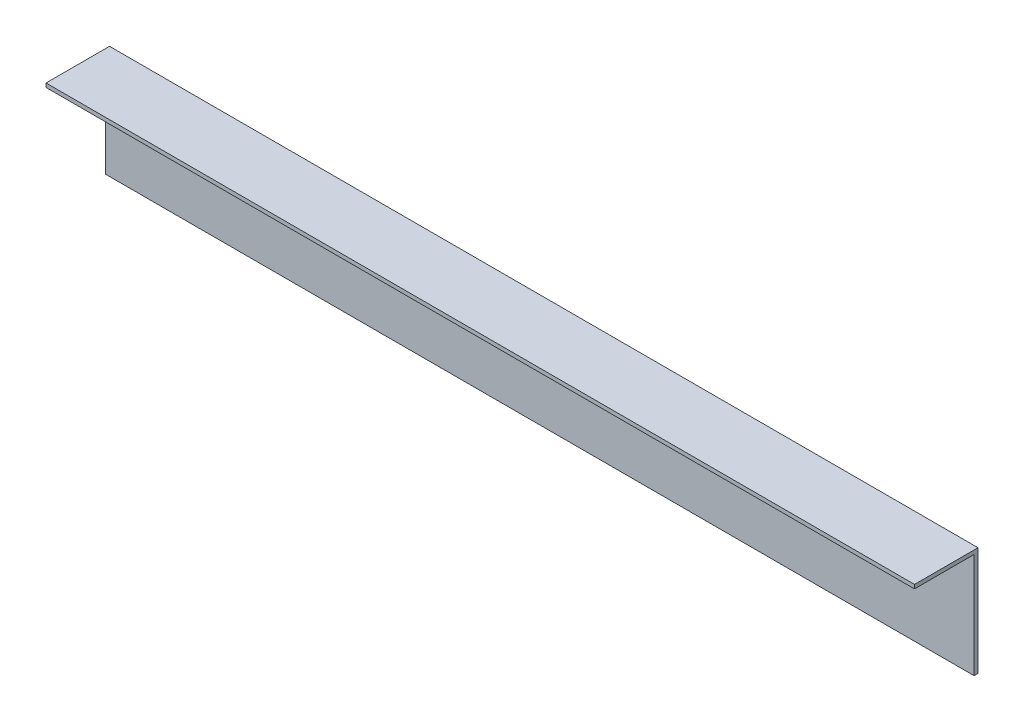
ISO-10303-21;
HEADER;
FILE_DESCRIPTION(('STEP AP214'),'2;1');
FILE_NAME('part.step','',(''),(''),'','','');
FILE_SCHEMA(('AUTOMOTIVE_DESIGN { 1 0 10303 214 1 1 1 1 }'));
ENDSEC;
DATA;
#1=APPLICATION_CONTEXT('core data for automotive mechanical design processes');
#2=APPLICATION_PROTOCOL_DEFINITION('international standard','automotive_design',2000,#1);
#3=PRODUCT_CONTEXT('',#1,'mechanical');
#4=PRODUCT('Part','Part','',(#3));
#5=PRODUCT_RELATED_PRODUCT_CATEGORY('part','',(#4));
#6=PRODUCT_DEFINITION_FORMATION('','',#4);
#7=PRODUCT_DEFINITION_CONTEXT('part definition',#1,'design');
#8=PRODUCT_DEFINITION('design','',#6,#7);
#9=PRODUCT_DEFINITION_SHAPE('','',#8);
#10=(LENGTH_UNIT() NAMED_UNIT(*) SI_UNIT(.MILLI.,.METRE.));
#11=(NAMED_UNIT(*) PLANE_ANGLE_UNIT() SI_UNIT($,.RADIAN.));
#12=(NAMED_UNIT(*) SI_UNIT($,.STERADIAN.) SOLID_ANGLE_UNIT());
#13=UNCERTAINTY_MEASURE_WITH_UNIT(LENGTH_MEASURE(1.E-05),#10,'distance_accuracy_value','');
#14=(GEOMETRIC_REPRESENTATION_CONTEXT(3) GLOBAL_UNCERTAINTY_ASSIGNED_CONTEXT((#13)) GLOBAL_UNIT_ASSIGNED_CONTEXT((#10,
#11,#12)) REPRESENTATION_CONTEXT('',''));
#15=CARTESIAN_POINT('',(0.,0.,0.));
#16=DIRECTION('',(0.,0.,1.));
#17=DIRECTION('',(1.,0.,0.));
#18=AXIS2_PLACEMENT_3D('',#15,#16,#17);
#19=CARTESIAN_POINT('',(-158.436378942368,-26.5104669887279,1.5));
#20=DIRECTION('',(1.,0.,0.));
#21=DIRECTION('',(0.,1.,0.));
#22=AXIS2_PLACEMENT_3D('',#19,#20,#21);
#23=PLANE('',#22);
#24=DIRECTION('',(0.,-1.,0.));
#25=VECTOR('',#24,1.);
#26=CARTESIAN_POINT('',(-158.436378942368,-26.5104669887279,0.));
#27=LINE('',#26,#25);
#28=CARTESIAN_POINT('',(-158.436378942368,-26.5104669887279,0.));
#29=VERTEX_POINT('',#28);
#30=CARTESIAN_POINT('',(-158.436378942368,-68.5104669887279,0.));
#31=VERTEX_POINT('',#30);
#32=EDGE_CURVE('E84',#29,#31,#27,.T.);
#33=ORIENTED_EDGE('',*,*,#32,.T.);
#34=DIRECTION('',(0.,0.,-1.));
#35=VECTOR('',#34,1.);
#36=CARTESIAN_POINT('',(-158.436378942368,-68.5104669887279,1.5));
#37=LINE('',#36,#35);
#38=CARTESIAN_POINT('',(-158.436378942368,-68.5104669887279,1.5));
#39=VERTEX_POINT('',#38);
#40=EDGE_CURVE('E11',#39,#31,#37,.T.);
#41=ORIENTED_EDGE('',*,*,#40,.F.);
#42=DIRECTION('',(0.,-1.,0.));
#43=VECTOR('',#42,1.);
#44=CARTESIAN_POINT('',(-158.436378942368,-26.5104669887279,1.5));
#45=LINE('',#44,#43);
#46=CARTESIAN_POINT('',(-158.436378942368,-28.0104669887279,1.5));
#47=VERTEX_POINT('',#46);
#48=EDGE_CURVE('E109',#47,#39,#45,.T.);
#49=ORIENTED_EDGE('',*,*,#48,.F.);
#50=DIRECTION('',(0.,0.,-1.));
#51=VECTOR('',#50,1.);
#52=CARTESIAN_POINT('',(-158.436378942368,-28.0104669887279,24.5));
#53=LINE('',#52,#51);
#54=CARTESIAN_POINT('',(-158.436378942368,-28.0104669887279,24.5));
#55=VERTEX_POINT('',#54);
#56=EDGE_CURVE('E103',#55,#47,#53,.T.);
#57=ORIENTED_EDGE('',*,*,#56,.F.);
#58=DIRECTION('',(0.,-1.,0.));
#59=VECTOR('',#58,1.);
#60=CARTESIAN_POINT('',(-158.436378942368,-26.5104669887279,24.5));
#61=LINE('',#60,#59);
#62=CARTESIAN_POINT('',(-158.436378942368,-26.5104669887279,24.5));
#63=VERTEX_POINT('',#62);
#64=EDGE_CURVE('E87',#63,#55,#61,.T.);
#65=ORIENTED_EDGE('',*,*,#64,.F.);
#66=DIRECTION('',(0.,0.,-1.));
#67=VECTOR('',#66,1.);
#68=CARTESIAN_POINT('',(-158.436378942368,-26.5104669887279,1.5));
#69=LINE('',#68,#67);
#70=EDGE_CURVE('E81',#63,#29,#69,.T.);
#71=ORIENTED_EDGE('',*,*,#70,.T.);
#72=EDGE_LOOP('',(#33,#41,#49,#57,#65,#71));
#73=FACE_BOUND('',#72,.T.);
#74=ADVANCED_FACE('F39',(#73),#23,.F.);
#75=CARTESIAN_POINT('',(-158.436378942368,-68.5104669887279,1.5));
#76=DIRECTION('',(0.,1.,0.));
#77=DIRECTION('',(0.,0.,1.));
#78=AXIS2_PLACEMENT_3D('',#75,#76,#77);
#79=PLANE('',#78);
#80=DIRECTION('',(1.,0.,0.));
#81=VECTOR('',#80,1.);
#82=CARTESIAN_POINT('',(-158.436378942368,-68.5104669887279,0.));
#83=LINE('',#82,#81);
#84=CARTESIAN_POINT('',(176.563621057632,-68.5104669887279,0.));
#85=VERTEX_POINT('',#84);
#86=EDGE_CURVE('E101',#31,#85,#83,.T.);
#87=ORIENTED_EDGE('',*,*,#86,.T.);
#88=DIRECTION('',(0.,0.,-1.));
#89=VECTOR('',#88,1.);
#90=CARTESIAN_POINT('',(176.563621057632,-68.5104669887279,1.5));
#91=LINE('',#90,#89);
#92=CARTESIAN_POINT('',(176.563621057632,-68.5104669887279,1.5));
#93=VERTEX_POINT('',#92);
#94=EDGE_CURVE('E47',#93,#85,#91,.T.);
#95=ORIENTED_EDGE('',*,*,#94,.F.);
#96=DIRECTION('',(1.,0.,0.));
#97=VECTOR('',#96,1.);
#98=CARTESIAN_POINT('',(-158.436378942368,-68.5104669887279,1.5));
#99=LINE('',#98,#97);
#100=EDGE_CURVE('E114',#39,#93,#99,.T.);
#101=ORIENTED_EDGE('',*,*,#100,.F.);
#102=ORIENTED_EDGE('',*,*,#40,.T.);
#103=EDGE_LOOP('',(#87,#95,#101,#102));
#104=FACE_BOUND('',#103,.T.);
#105=ADVANCED_FACE('F125',(#104),#79,.F.);
#106=CARTESIAN_POINT('',(176.563621057632,-26.5104669887279,1.5));
#107=DIRECTION('',(1.,0.,0.));
#108=DIRECTION('',(0.,1.,0.));
#109=AXIS2_PLACEMENT_3D('',#106,#107,#108);
#110=PLANE('',#109);
#111=DIRECTION('',(0.,-1.,0.));
#112=VECTOR('',#111,1.);
#113=CARTESIAN_POINT('',(176.563621057632,-26.5104669887279,0.));
#114=LINE('',#113,#112);
#115=CARTESIAN_POINT('',(176.563621057632,-26.5104669887279,0.));
#116=VERTEX_POINT('',#115);
#117=EDGE_CURVE('E110',#116,#85,#114,.T.);
#118=ORIENTED_EDGE('',*,*,#117,.F.);
#119=DIRECTION('',(0.,0.,-1.));
#120=VECTOR('',#119,1.);
#121=CARTESIAN_POINT('',(176.563621057632,-26.5104669887279,1.5));
#122=LINE('',#121,#120);
#123=CARTESIAN_POINT('',(176.563621057632,-26.5104669887279,24.5));
#124=VERTEX_POINT('',#123);
#125=EDGE_CURVE('E93',#124,#116,#122,.T.);
#126=ORIENTED_EDGE('',*,*,#125,.F.);
#127=DIRECTION('',(0.,1.,0.));
#128=VECTOR('',#127,1.);
#129=CARTESIAN_POINT('',(176.563621057632,-26.5104669887279,24.5));
#130=LINE('',#129,#128);
#131=CARTESIAN_POINT('',(176.563621057632,-28.0104669887279,24.5));
#132=VERTEX_POINT('',#131);
#133=EDGE_CURVE('E143',#132,#124,#130,.T.);
#134=ORIENTED_EDGE('',*,*,#133,.F.);
#135=DIRECTION('',(0.,0.,-1.));
#136=VECTOR('',#135,1.);
#137=CARTESIAN_POINT('',(176.563621057632,-28.0104669887279,24.5));
#138=LINE('',#137,#136);
#139=CARTESIAN_POINT('',(176.563621057632,-28.0104669887279,1.5));
#140=VERTEX_POINT('',#139);
#141=EDGE_CURVE('E135',#132,#140,#138,.T.);
#142=ORIENTED_EDGE('',*,*,#141,.T.);
#143=DIRECTION('',(0.,-1.,0.));
#144=VECTOR('',#143,1.);
#145=CARTESIAN_POINT('',(176.563621057632,-26.5104669887279,1.5));
#146=LINE('',#145,#144);
#147=EDGE_CURVE('E62',#140,#93,#146,.T.);
#148=ORIENTED_EDGE('',*,*,#147,.T.);
#149=ORIENTED_EDGE('',*,*,#94,.T.);
#150=EDGE_LOOP('',(#118,#126,#134,#142,#148,#149));
#151=FACE_BOUND('',#150,.T.);
#152=ADVANCED_FACE('F122',(#151),#110,.T.);
#153=CARTESIAN_POINT('',(-158.436378942368,-26.5104669887279,1.5));
#154=DIRECTION('',(0.,1.,0.));
#155=DIRECTION('',(0.,0.,1.));
#156=AXIS2_PLACEMENT_3D('',#153,#154,#155);
#157=PLANE('',#156);
#158=DIRECTION('',(1.,0.,0.));
#159=VECTOR('',#158,1.);
#160=CARTESIAN_POINT('',(-158.436378942368,-26.5104669887279,0.));
#161=LINE('',#160,#159);
#162=EDGE_CURVE('E99',#29,#116,#161,.T.);
#163=ORIENTED_EDGE('',*,*,#162,.F.);
#164=ORIENTED_EDGE('',*,*,#70,.F.);
#165=DIRECTION('',(-1.,0.,0.));
#166=VECTOR('',#165,1.);
#167=CARTESIAN_POINT('',(-158.436378942368,-26.5104669887279,24.5));
#168=LINE('',#167,#166);
#169=EDGE_CURVE('E138',#124,#63,#168,.T.);
#170=ORIENTED_EDGE('',*,*,#169,.F.);
#171=ORIENTED_EDGE('',*,*,#125,.T.);
#172=EDGE_LOOP('',(#163,#164,#170,#171));
#173=FACE_BOUND('',#172,.T.);
#174=ADVANCED_FACE('F105',(#173),#157,.T.);
#175=CARTESIAN_POINT('',(0.,0.,1.5));
#176=DIRECTION('',(0.,0.,1.));
#177=DIRECTION('',(1.,0.,0.));
#178=AXIS2_PLACEMENT_3D('',#175,#176,#177);
#179=PLANE('',#178);
#180=DIRECTION('',(1.,0.,0.));
#181=VECTOR('',#180,1.);
#182=CARTESIAN_POINT('',(-158.436378942368,-28.0104669887279,1.5));
#183=LINE('',#182,#181);
#184=EDGE_CURVE('E54',#47,#140,#183,.T.);
#185=ORIENTED_EDGE('',*,*,#184,.F.);
#186=ORIENTED_EDGE('',*,*,#48,.T.);
#187=ORIENTED_EDGE('',*,*,#100,.T.);
#188=ORIENTED_EDGE('',*,*,#147,.F.);
#189=EDGE_LOOP('',(#185,#186,#187,#188));
#190=FACE_BOUND('',#189,.T.);
#191=ADVANCED_FACE('F167',(#190),#179,.T.);
#192=CARTESIAN_POINT('',(0.,0.,0.));
#193=DIRECTION('',(0.,0.,1.));
#194=DIRECTION('',(1.,0.,0.));
#195=AXIS2_PLACEMENT_3D('',#192,#193,#194);
#196=PLANE('',#195);
#197=ORIENTED_EDGE('',*,*,#32,.F.);
#198=ORIENTED_EDGE('',*,*,#162,.T.);
#199=ORIENTED_EDGE('',*,*,#117,.T.);
#200=ORIENTED_EDGE('',*,*,#86,.F.);
#201=EDGE_LOOP('',(#197,#198,#199,#200));
#202=FACE_BOUND('',#201,.T.);
#203=ADVANCED_FACE('F97',(#202),#196,.F.);
#204=CARTESIAN_POINT('',(-158.436378942368,-28.0104669887279,24.5));
#205=DIRECTION('',(0.,1.,0.));
#206=DIRECTION('',(0.,0.,1.));
#207=AXIS2_PLACEMENT_3D('',#204,#205,#206);
#208=PLANE('',#207);
#209=ORIENTED_EDGE('',*,*,#184,.T.);
#210=ORIENTED_EDGE('',*,*,#141,.F.);
#211=DIRECTION('',(1.,0.,0.));
#212=VECTOR('',#211,1.);
#213=CARTESIAN_POINT('',(-158.436378942368,-28.0104669887279,24.5));
#214=LINE('',#213,#212);
#215=EDGE_CURVE('E147',#55,#132,#214,.T.);
#216=ORIENTED_EDGE('',*,*,#215,.F.);
#217=ORIENTED_EDGE('',*,*,#56,.T.);
#218=EDGE_LOOP('',(#209,#210,#216,#217));
#219=FACE_BOUND('',#218,.T.);
#220=ADVANCED_FACE('F161',(#219),#208,.F.);
#221=CARTESIAN_POINT('',(0.,0.,24.5));
#222=DIRECTION('',(0.,0.,1.));
#223=DIRECTION('',(1.,0.,0.));
#224=AXIS2_PLACEMENT_3D('',#221,#222,#223);
#225=PLANE('',#224);
#226=ORIENTED_EDGE('',*,*,#64,.T.);
#227=ORIENTED_EDGE('',*,*,#215,.T.);
#228=ORIENTED_EDGE('',*,*,#133,.T.);
#229=ORIENTED_EDGE('',*,*,#169,.T.);
#230=EDGE_LOOP('',(#226,#227,#228,#229));
#231=FACE_BOUND('',#230,.T.);
#232=ADVANCED_FACE('F154',(#231),#225,.T.);
#233=CLOSED_SHELL('',(#74,#105,#152,#174,#191,#203,#220,#232));
#234=MANIFOLD_SOLID_BREP('B2',#233);
#235=ADVANCED_BREP_SHAPE_REPRESENTATION('',(#18,#234),#14);
#236=SHAPE_DEFINITION_REPRESENTATION(#9,#235);
ENDSEC;
END-ISO-10303-21;
